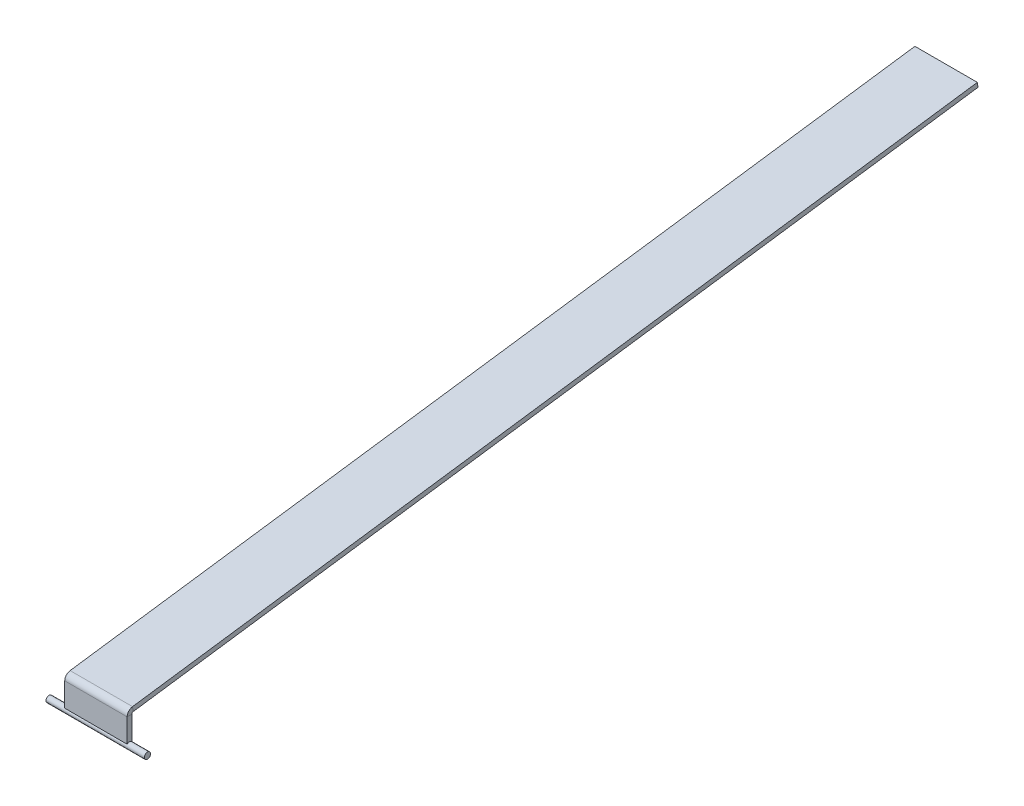
ISO-10303-21;
HEADER;
FILE_DESCRIPTION(('STEP AP214'),'2;1');
FILE_NAME('part.step','',(''),(''),'','','');
FILE_SCHEMA(('AUTOMOTIVE_DESIGN { 1 0 10303 214 1 1 1 1 }'));
ENDSEC;
DATA;
#1=APPLICATION_CONTEXT('core data for automotive mechanical design processes');
#2=APPLICATION_PROTOCOL_DEFINITION('international standard','automotive_design',2000,#1);
#3=PRODUCT_CONTEXT('',#1,'mechanical');
#4=PRODUCT('Part','Part','',(#3));
#5=PRODUCT_RELATED_PRODUCT_CATEGORY('part','',(#4));
#6=PRODUCT_DEFINITION_FORMATION('','',#4);
#7=PRODUCT_DEFINITION_CONTEXT('part definition',#1,'design');
#8=PRODUCT_DEFINITION('design','',#6,#7);
#9=PRODUCT_DEFINITION_SHAPE('','',#8);
#10=(LENGTH_UNIT() NAMED_UNIT(*) SI_UNIT(.MILLI.,.METRE.));
#11=(NAMED_UNIT(*) PLANE_ANGLE_UNIT() SI_UNIT($,.RADIAN.));
#12=(NAMED_UNIT(*) SI_UNIT($,.STERADIAN.) SOLID_ANGLE_UNIT());
#13=UNCERTAINTY_MEASURE_WITH_UNIT(LENGTH_MEASURE(1.E-05),#10,'distance_accuracy_value','');
#14=(GEOMETRIC_REPRESENTATION_CONTEXT(3) GLOBAL_UNCERTAINTY_ASSIGNED_CONTEXT((#13)) GLOBAL_UNIT_ASSIGNED_CONTEXT((#10,
#11,#12)) REPRESENTATION_CONTEXT('',''));
#15=CARTESIAN_POINT('',(0.,0.,0.));
#16=DIRECTION('',(0.,0.,1.));
#17=DIRECTION('',(1.,0.,0.));
#18=AXIS2_PLACEMENT_3D('',#15,#16,#17);
#19=CARTESIAN_POINT('',(2.,0.,0.));
#20=DIRECTION('',(0.,0.,1.));
#21=DIRECTION('',(1.,0.,0.));
#22=AXIS2_PLACEMENT_3D('',#19,#20,#21);
#23=PLANE('',#22);
#24=DIRECTION('',(0.,1.,0.));
#25=VECTOR('',#24,1.);
#26=CARTESIAN_POINT('',(-2.,0.,0.));
#27=LINE('',#26,#25);
#28=CARTESIAN_POINT('',(-2.,0.33228756555323,0.));
#29=VERTEX_POINT('',#28);
#30=CARTESIAN_POINT('',(-2.,1.85207502322455,0.));
#31=VERTEX_POINT('',#30);
#32=EDGE_CURVE('E163',#29,#31,#27,.T.);
#33=ORIENTED_EDGE('',*,*,#32,.F.);
#34=DIRECTION('',(-1.,0.,0.));
#35=VECTOR('',#34,1.);
#36=CARTESIAN_POINT('',(3.15,0.33228756555323,0.));
#37=LINE('',#36,#35);
#38=CARTESIAN_POINT('',(2.,0.33228756555323,0.));
#39=VERTEX_POINT('',#38);
#40=EDGE_CURVE('E120',#29,#39,#37,.F.);
#41=ORIENTED_EDGE('',*,*,#40,.T.);
#42=DIRECTION('',(0.,1.,0.));
#43=VECTOR('',#42,1.);
#44=CARTESIAN_POINT('',(2.,0.,0.));
#45=LINE('',#44,#43);
#46=CARTESIAN_POINT('',(2.,1.85207502322455,0.));
#47=VERTEX_POINT('',#46);
#48=EDGE_CURVE('E112',#39,#47,#45,.T.);
#49=ORIENTED_EDGE('',*,*,#48,.T.);
#50=DIRECTION('',(-1.,0.,0.));
#51=VECTOR('',#50,1.);
#52=CARTESIAN_POINT('',(2.,1.85207502322455,0.));
#53=LINE('',#52,#51);
#54=EDGE_CURVE('E116',#47,#31,#53,.T.);
#55=ORIENTED_EDGE('',*,*,#54,.T.);
#56=EDGE_LOOP('',(#33,#41,#49,#55));
#57=FACE_BOUND('',#56,.T.);
#58=ADVANCED_FACE('F43',(#57),#23,.T.);
#59=CARTESIAN_POINT('',(2.,0.,-0.3));
#60=DIRECTION('',(0.,0.,1.));
#61=DIRECTION('',(1.,0.,0.));
#62=AXIS2_PLACEMENT_3D('',#59,#60,#61);
#63=PLANE('',#62);
#64=DIRECTION('',(-1.,0.,0.));
#65=VECTOR('',#64,1.);
#66=CARTESIAN_POINT('',(3.15,0.33228756555323,-0.3));
#67=LINE('',#66,#65);
#68=CARTESIAN_POINT('',(-2.,0.33228756555323,-0.3));
#69=VERTEX_POINT('',#68);
#70=CARTESIAN_POINT('',(2.,0.33228756555323,-0.3));
#71=VERTEX_POINT('',#70);
#72=EDGE_CURVE('E58',#69,#71,#67,.F.);
#73=ORIENTED_EDGE('',*,*,#72,.F.);
#74=DIRECTION('',(0.,1.,0.));
#75=VECTOR('',#74,1.);
#76=CARTESIAN_POINT('',(-2.,0.,-0.3));
#77=LINE('',#76,#75);
#78=CARTESIAN_POINT('',(-2.,1.85207502322455,-0.3));
#79=VERTEX_POINT('',#78);
#80=EDGE_CURVE('E165',#69,#79,#77,.T.);
#81=ORIENTED_EDGE('',*,*,#80,.T.);
#82=DIRECTION('',(-1.,0.,0.));
#83=VECTOR('',#82,1.);
#84=CARTESIAN_POINT('',(2.,1.85207502322455,-0.3));
#85=LINE('',#84,#83);
#86=CARTESIAN_POINT('',(2.,1.85207502322455,-0.3));
#87=VERTEX_POINT('',#86);
#88=EDGE_CURVE('E138',#87,#79,#85,.T.);
#89=ORIENTED_EDGE('',*,*,#88,.F.);
#90=DIRECTION('',(0.,1.,0.));
#91=VECTOR('',#90,1.);
#92=CARTESIAN_POINT('',(2.,0.,-0.3));
#93=LINE('',#92,#91);
#94=EDGE_CURVE('E122',#71,#87,#93,.T.);
#95=ORIENTED_EDGE('',*,*,#94,.F.);
#96=EDGE_LOOP('',(#73,#81,#89,#95));
#97=FACE_BOUND('',#96,.T.);
#98=ADVANCED_FACE('F205',(#97),#63,.F.);
#99=CARTESIAN_POINT('',(-2.,1.95111014481228,-0.386141980945912));
#100=DIRECTION('',(-1.,0.,0.));
#101=DIRECTION('',(0.,0.,1.));
#102=AXIS2_PLACEMENT_3D('',#99,#100,#101);
#103=PLANE('',#102);
#104=ORIENTED_EDGE('',*,*,#80,.F.);
#105=CARTESIAN_POINT('',(-2.,0.2,-0.15));
#106=DIRECTION('',(-1.,0.,0.));
#107=DIRECTION('',(0.,0.,1.));
#108=AXIS2_PLACEMENT_3D('',#105,#106,#107);
#109=CIRCLE('',#108,0.2);
#110=EDGE_CURVE('E314',#69,#29,#109,.F.);
#111=ORIENTED_EDGE('',*,*,#110,.T.);
#112=ORIENTED_EDGE('',*,*,#32,.T.);
#113=DIRECTION('',(0.,0.,-1.));
#114=VECTOR('',#113,1.);
#115=CARTESIAN_POINT('',(-2.,1.85207502322455,0.));
#116=LINE('',#115,#114);
#117=EDGE_CURVE('E131',#31,#79,#116,.T.);
#118=ORIENTED_EDGE('',*,*,#117,.T.);
#119=EDGE_LOOP('',(#104,#111,#112,#118));
#120=FACE_BOUND('',#119,.T.);
#121=ADVANCED_FACE('F183',(#120),#103,.T.);
#122=CARTESIAN_POINT('',(2.,1.85207502322455,-0.4));
#123=DIRECTION('',(1.,0.,0.));
#124=DIRECTION('',(0.,0.,-1.));
#125=AXIS2_PLACEMENT_3D('',#122,#123,#124);
#126=PLANE('',#125);
#127=ORIENTED_EDGE('',*,*,#48,.F.);
#128=CARTESIAN_POINT('',(2.,0.2,-0.15));
#129=DIRECTION('',(1.,0.,0.));
#130=DIRECTION('',(0.,0.,-1.));
#131=AXIS2_PLACEMENT_3D('',#128,#129,#130);
#132=CIRCLE('',#131,0.2);
#133=EDGE_CURVE('E308',#39,#71,#132,.F.);
#134=ORIENTED_EDGE('',*,*,#133,.T.);
#135=ORIENTED_EDGE('',*,*,#94,.T.);
#136=DIRECTION('',(0.,0.,1.));
#137=VECTOR('',#136,1.);
#138=CARTESIAN_POINT('',(2.,1.85207502322455,-0.3));
#139=LINE('',#138,#137);
#140=EDGE_CURVE('E51',#87,#47,#139,.T.);
#141=ORIENTED_EDGE('',*,*,#140,.T.);
#142=EDGE_LOOP('',(#127,#134,#135,#141));
#143=FACE_BOUND('',#142,.T.);
#144=ADVANCED_FACE('F126',(#143),#126,.T.);
#145=CARTESIAN_POINT('',(2.,2.24821550957547,-0.344567923783648));
#146=DIRECTION('',(1.,0.,0.));
#147=DIRECTION('',(0.,0.,-1.));
#148=AXIS2_PLACEMENT_3D('',#145,#146,#147);
#149=PLANE('',#148);
#150=DIRECTION('',(0.,-0.990351215877303,-0.138580190540881));
#151=VECTOR('',#150,1.);
#152=CARTESIAN_POINT('',(2.,2.24821550957547,-0.344567923783648));
#153=LINE('',#152,#151);
#154=CARTESIAN_POINT('',(2.,2.24821550957547,-0.344567923783648));
#155=VERTEX_POINT('',#154);
#156=CARTESIAN_POINT('',(2.,1.95111014481228,-0.386141980945912));
#157=VERTEX_POINT('',#156);
#158=EDGE_CURVE('E11',#155,#157,#153,.T.);
#159=ORIENTED_EDGE('',*,*,#158,.F.);
#160=CARTESIAN_POINT('',(2.,1.85207502322455,-0.4));
#161=DIRECTION('',(1.,0.,0.));
#162=DIRECTION('',(0.,0.,-1.));
#163=AXIS2_PLACEMENT_3D('',#160,#161,#162);
#164=CIRCLE('',#163,0.4);
#165=EDGE_CURVE('E123',#47,#155,#164,.F.);
#166=ORIENTED_EDGE('',*,*,#165,.F.);
#167=ORIENTED_EDGE('',*,*,#140,.F.);
#168=CARTESIAN_POINT('',(2.,1.85207502322455,-0.4));
#169=DIRECTION('',(1.,0.,0.));
#170=DIRECTION('',(0.,0.,-1.));
#171=AXIS2_PLACEMENT_3D('',#168,#169,#170);
#172=CIRCLE('',#171,0.1);
#173=EDGE_CURVE('E149',#87,#157,#172,.F.);
#174=ORIENTED_EDGE('',*,*,#173,.T.);
#175=EDGE_LOOP('',(#159,#166,#167,#174));
#176=FACE_BOUND('',#175,.T.);
#177=ADVANCED_FACE('F45',(#176),#149,.T.);
#178=CARTESIAN_POINT('',(2.,1.85207502322455,-0.3));
#179=DIRECTION('',(1.,0.,0.));
#180=DIRECTION('',(0.,0.,-1.));
#181=AXIS2_PLACEMENT_3D('',#178,#179,#180);
#182=PLANE('',#181);
#183=DIRECTION('',(0.,0.13858019054088,-0.990351215877304));
#184=VECTOR('',#183,1.);
#185=CARTESIAN_POINT('',(2.,2.2,0.));
#186=LINE('',#185,#184);
#187=CARTESIAN_POINT('',(2.,9.82191047974842,-54.4693168732517));
#188=VERTEX_POINT('',#187);
#189=EDGE_CURVE('E141',#155,#188,#186,.T.);
#190=ORIENTED_EDGE('',*,*,#189,.F.);
#191=ORIENTED_EDGE('',*,*,#158,.T.);
#192=DIRECTION('',(0.,0.13858019054088,-0.990351215877304));
#193=VECTOR('',#192,1.);
#194=CARTESIAN_POINT('',(2.,1.90289463523681,-0.0415740571622641));
#195=LINE('',#194,#193);
#196=CARTESIAN_POINT('',(2.,9.52480511498523,-54.510890930414));
#197=VERTEX_POINT('',#196);
#198=EDGE_CURVE('E99',#157,#197,#195,.T.);
#199=ORIENTED_EDGE('',*,*,#198,.T.);
#200=DIRECTION('',(0.,-0.990351215877297,-0.138580190540925));
#201=VECTOR('',#200,1.);
#202=CARTESIAN_POINT('',(2.,9.82191047974842,-54.4693168732517));
#203=LINE('',#202,#201);
#204=EDGE_CURVE('E144',#188,#197,#203,.T.);
#205=ORIENTED_EDGE('',*,*,#204,.F.);
#206=EDGE_LOOP('',(#190,#191,#199,#205));
#207=FACE_BOUND('',#206,.T.);
#208=ADVANCED_FACE('F194',(#207),#182,.T.);
#209=CARTESIAN_POINT('',(-2.,1.85207502322455,0.));
#210=DIRECTION('',(-1.,0.,0.));
#211=DIRECTION('',(0.,0.,1.));
#212=AXIS2_PLACEMENT_3D('',#209,#210,#211);
#213=PLANE('',#212);
#214=ORIENTED_EDGE('',*,*,#117,.F.);
#215=CARTESIAN_POINT('',(-2.,1.85207502322455,-0.4));
#216=DIRECTION('',(1.,0.,0.));
#217=DIRECTION('',(0.,0.,-1.));
#218=AXIS2_PLACEMENT_3D('',#215,#216,#217);
#219=CIRCLE('',#218,0.4);
#220=CARTESIAN_POINT('',(-2.,2.24821550957547,-0.344567923783648));
#221=VERTEX_POINT('',#220);
#222=EDGE_CURVE('E136',#31,#221,#219,.F.);
#223=ORIENTED_EDGE('',*,*,#222,.T.);
#224=DIRECTION('',(0.,0.990351215877303,0.138580190540881));
#225=VECTOR('',#224,1.);
#226=CARTESIAN_POINT('',(-2.,1.95111014481228,-0.386141980945912));
#227=LINE('',#226,#225);
#228=CARTESIAN_POINT('',(-2.,1.95111014481228,-0.386141980945912));
#229=VERTEX_POINT('',#228);
#230=EDGE_CURVE('E93',#229,#221,#227,.T.);
#231=ORIENTED_EDGE('',*,*,#230,.F.);
#232=CARTESIAN_POINT('',(-2.,1.85207502322455,-0.4));
#233=DIRECTION('',(1.,0.,0.));
#234=DIRECTION('',(0.,0.,-1.));
#235=AXIS2_PLACEMENT_3D('',#232,#233,#234);
#236=CIRCLE('',#235,0.1);
#237=EDGE_CURVE('E167',#79,#229,#236,.F.);
#238=ORIENTED_EDGE('',*,*,#237,.F.);
#239=EDGE_LOOP('',(#214,#223,#231,#238));
#240=FACE_BOUND('',#239,.T.);
#241=ADVANCED_FACE('F191',(#240),#213,.T.);
#242=CARTESIAN_POINT('',(2.,1.90289463523681,-0.0415740571622641));
#243=DIRECTION('',(0.,0.990351215877303,0.13858019054088));
#244=DIRECTION('',(0.,-0.13858019054088,0.990351215877303));
#245=AXIS2_PLACEMENT_3D('',#242,#243,#244);
#246=PLANE('',#245);
#247=DIRECTION('',(0.,0.13858019054088,-0.990351215877304));
#248=VECTOR('',#247,1.);
#249=CARTESIAN_POINT('',(-2.,1.90289463523681,-0.0415740571622641));
#250=LINE('',#249,#248);
#251=CARTESIAN_POINT('',(-2.,9.52480511498523,-54.510890930414));
#252=VERTEX_POINT('',#251);
#253=EDGE_CURVE('E152',#229,#252,#250,.T.);
#254=ORIENTED_EDGE('',*,*,#253,.T.);
#255=DIRECTION('',(-1.,0.,0.));
#256=VECTOR('',#255,1.);
#257=CARTESIAN_POINT('',(2.,9.52480511498523,-54.510890930414));
#258=LINE('',#257,#256);
#259=EDGE_CURVE('E176',#197,#252,#258,.T.);
#260=ORIENTED_EDGE('',*,*,#259,.F.);
#261=ORIENTED_EDGE('',*,*,#198,.F.);
#262=DIRECTION('',(-1.,0.,0.));
#263=VECTOR('',#262,1.);
#264=CARTESIAN_POINT('',(2.,1.95111014481228,-0.386141980945912));
#265=LINE('',#264,#263);
#266=EDGE_CURVE('E151',#157,#229,#265,.T.);
#267=ORIENTED_EDGE('',*,*,#266,.T.);
#268=EDGE_LOOP('',(#254,#260,#261,#267));
#269=FACE_BOUND('',#268,.T.);
#270=ADVANCED_FACE('F193',(#269),#246,.F.);
#271=CARTESIAN_POINT('',(2.,9.82191047974842,-54.4693168732517));
#272=DIRECTION('',(0.,0.138580190540925,-0.990351215877297));
#273=DIRECTION('',(0.,0.990351215877297,0.138580190540925));
#274=AXIS2_PLACEMENT_3D('',#271,#272,#273);
#275=PLANE('',#274);
#276=DIRECTION('',(0.,-0.990351215877297,-0.138580190540925));
#277=VECTOR('',#276,1.);
#278=CARTESIAN_POINT('',(-2.,9.82191047974842,-54.4693168732517));
#279=LINE('',#278,#277);
#280=CARTESIAN_POINT('',(-2.,9.82191047974842,-54.4693168732517));
#281=VERTEX_POINT('',#280);
#282=EDGE_CURVE('E155',#281,#252,#279,.T.);
#283=ORIENTED_EDGE('',*,*,#282,.F.);
#284=DIRECTION('',(-1.,0.,0.));
#285=VECTOR('',#284,1.);
#286=CARTESIAN_POINT('',(2.,9.82191047974842,-54.4693168732517));
#287=LINE('',#286,#285);
#288=EDGE_CURVE('E174',#188,#281,#287,.T.);
#289=ORIENTED_EDGE('',*,*,#288,.F.);
#290=ORIENTED_EDGE('',*,*,#204,.T.);
#291=ORIENTED_EDGE('',*,*,#259,.T.);
#292=EDGE_LOOP('',(#283,#289,#290,#291));
#293=FACE_BOUND('',#292,.T.);
#294=ADVANCED_FACE('F200',(#293),#275,.T.);
#295=CARTESIAN_POINT('',(2.,2.2,0.));
#296=DIRECTION('',(0.,0.990351215877303,0.13858019054088));
#297=DIRECTION('',(0.,-0.13858019054088,0.990351215877303));
#298=AXIS2_PLACEMENT_3D('',#295,#296,#297);
#299=PLANE('',#298);
#300=DIRECTION('',(0.,0.13858019054088,-0.990351215877304));
#301=VECTOR('',#300,1.);
#302=CARTESIAN_POINT('',(-2.,2.2,0.));
#303=LINE('',#302,#301);
#304=EDGE_CURVE('E159',#221,#281,#303,.T.);
#305=ORIENTED_EDGE('',*,*,#304,.F.);
#306=DIRECTION('',(-1.,0.,0.));
#307=VECTOR('',#306,1.);
#308=CARTESIAN_POINT('',(2.,2.24821550957547,-0.344567923783648));
#309=LINE('',#308,#307);
#310=EDGE_CURVE('E137',#155,#221,#309,.T.);
#311=ORIENTED_EDGE('',*,*,#310,.F.);
#312=ORIENTED_EDGE('',*,*,#189,.T.);
#313=ORIENTED_EDGE('',*,*,#288,.T.);
#314=EDGE_LOOP('',(#305,#311,#312,#313));
#315=FACE_BOUND('',#314,.T.);
#316=ADVANCED_FACE('F216',(#315),#299,.T.);
#317=CARTESIAN_POINT('',(2.,1.85207502322455,-0.4));
#318=DIRECTION('',(-1.,0.,0.));
#319=DIRECTION('',(0.,0.,1.));
#320=AXIS2_PLACEMENT_3D('',#317,#318,#319);
#321=CYLINDRICAL_SURFACE('',#320,0.4);
#322=ORIENTED_EDGE('',*,*,#222,.F.);
#323=ORIENTED_EDGE('',*,*,#54,.F.);
#324=ORIENTED_EDGE('',*,*,#165,.T.);
#325=ORIENTED_EDGE('',*,*,#310,.T.);
#326=EDGE_LOOP('',(#322,#323,#324,#325));
#327=FACE_BOUND('',#326,.T.);
#328=ADVANCED_FACE('F134',(#327),#321,.T.);
#329=CARTESIAN_POINT('',(2.,1.85207502322455,-0.4));
#330=DIRECTION('',(-1.,0.,0.));
#331=DIRECTION('',(0.,0.,1.));
#332=AXIS2_PLACEMENT_3D('',#329,#330,#331);
#333=CYLINDRICAL_SURFACE('',#332,0.1);
#334=ORIENTED_EDGE('',*,*,#237,.T.);
#335=ORIENTED_EDGE('',*,*,#266,.F.);
#336=ORIENTED_EDGE('',*,*,#173,.F.);
#337=ORIENTED_EDGE('',*,*,#88,.T.);
#338=EDGE_LOOP('',(#334,#335,#336,#337));
#339=FACE_BOUND('',#338,.T.);
#340=ADVANCED_FACE('F188',(#339),#333,.F.);
#341=CARTESIAN_POINT('',(-2.,1.85207502322455,-0.4));
#342=DIRECTION('',(1.,0.,0.));
#343=DIRECTION('',(0.,0.,-1.));
#344=AXIS2_PLACEMENT_3D('',#341,#342,#343);
#345=PLANE('',#344);
#346=ORIENTED_EDGE('',*,*,#253,.F.);
#347=ORIENTED_EDGE('',*,*,#230,.T.);
#348=ORIENTED_EDGE('',*,*,#304,.T.);
#349=ORIENTED_EDGE('',*,*,#282,.T.);
#350=EDGE_LOOP('',(#346,#347,#348,#349));
#351=FACE_BOUND('',#350,.T.);
#352=ADVANCED_FACE('F236',(#351),#345,.F.);
#353=CARTESIAN_POINT('',(3.15,0.2,-0.15));
#354=DIRECTION('',(-1.,0.,0.));
#355=DIRECTION('',(0.,0.,1.));
#356=AXIS2_PLACEMENT_3D('',#353,#354,#355);
#357=CYLINDRICAL_SURFACE('',#356,0.2);
#358=CARTESIAN_POINT('',(2.,0.2,-0.15));
#359=DIRECTION('',(-1.,0.,0.));
#360=DIRECTION('',(0.,-0.661437827766148,-0.75));
#361=AXIS2_PLACEMENT_3D('',#358,#359,#360);
#362=CIRCLE('',#361,0.2);
#363=CARTESIAN_POINT('',(2.,0.0677124344467704,-0.3));
#364=VERTEX_POINT('',#363);
#365=CARTESIAN_POINT('',(2.,0.0677124344467704,0.));
#366=VERTEX_POINT('',#365);
#367=EDGE_CURVE('E156',#364,#366,#362,.T.);
#368=ORIENTED_EDGE('',*,*,#367,.T.);
#369=ORIENTED_EDGE('',*,*,#367,.F.);
#370=EDGE_LOOP('',(#368,#369));
#371=FACE_BOUND('',#370,.T.);
#372=CARTESIAN_POINT('',(-2.,0.2,-0.15));
#373=DIRECTION('',(-1.,0.,0.));
#374=DIRECTION('',(0.,-0.661437827766148,-0.75));
#375=AXIS2_PLACEMENT_3D('',#372,#373,#374);
#376=CIRCLE('',#375,0.2);
#377=CARTESIAN_POINT('',(-2.,0.0677124344467704,-0.3));
#378=VERTEX_POINT('',#377);
#379=CARTESIAN_POINT('',(-2.,0.0677124344467704,0.));
#380=VERTEX_POINT('',#379);
#381=EDGE_CURVE('E316',#378,#380,#376,.T.);
#382=ORIENTED_EDGE('',*,*,#381,.F.);
#383=ORIENTED_EDGE('',*,*,#381,.T.);
#384=EDGE_LOOP('',(#382,#383));
#385=FACE_BOUND('',#384,.T.);
#386=ORIENTED_EDGE('',*,*,#110,.F.);
#387=ORIENTED_EDGE('',*,*,#72,.T.);
#388=ORIENTED_EDGE('',*,*,#133,.F.);
#389=ORIENTED_EDGE('',*,*,#40,.F.);
#390=EDGE_LOOP('',(#386,#387,#388,#389));
#391=FACE_BOUND('',#390,.T.);
#392=CARTESIAN_POINT('',(3.15,0.2,-0.15));
#393=DIRECTION('',(1.,0.,0.));
#394=DIRECTION('',(0.,0.,-1.));
#395=AXIS2_PLACEMENT_3D('',#392,#393,#394);
#396=CIRCLE('',#395,0.2);
#397=CARTESIAN_POINT('',(3.15,0.2,-0.35));
#398=VERTEX_POINT('',#397);
#399=EDGE_CURVE('E305',#398,#398,#396,.T.);
#400=ORIENTED_EDGE('',*,*,#399,.F.);
#401=EDGE_LOOP('',(#400));
#402=FACE_BOUND('',#401,.T.);
#403=CARTESIAN_POINT('',(-3.15,0.2,-0.15));
#404=DIRECTION('',(1.,0.,0.));
#405=DIRECTION('',(0.,0.,-1.));
#406=AXIS2_PLACEMENT_3D('',#403,#404,#405);
#407=CIRCLE('',#406,0.2);
#408=CARTESIAN_POINT('',(-3.15,0.2,-0.35));
#409=VERTEX_POINT('',#408);
#410=EDGE_CURVE('E303',#409,#409,#407,.T.);
#411=ORIENTED_EDGE('',*,*,#410,.T.);
#412=EDGE_LOOP('',(#411));
#413=FACE_BOUND('',#412,.T.);
#414=ADVANCED_FACE('F233',(#371,#385,#391,#402,#413),#357,.T.);
#415=CARTESIAN_POINT('',(3.15,0.2,-0.15));
#416=DIRECTION('',(1.,0.,0.));
#417=DIRECTION('',(0.,0.,-1.));
#418=AXIS2_PLACEMENT_3D('',#415,#416,#417);
#419=PLANE('',#418);
#420=ORIENTED_EDGE('',*,*,#399,.T.);
#421=EDGE_LOOP('',(#420));
#422=FACE_BOUND('',#421,.T.);
#423=ADVANCED_FACE('F280',(#422),#419,.T.);
#424=CARTESIAN_POINT('',(-3.15,0.2,-0.15));
#425=DIRECTION('',(1.,0.,0.));
#426=DIRECTION('',(0.,0.,-1.));
#427=AXIS2_PLACEMENT_3D('',#424,#425,#426);
#428=PLANE('',#427);
#429=ORIENTED_EDGE('',*,*,#410,.F.);
#430=EDGE_LOOP('',(#429));
#431=FACE_BOUND('',#430,.T.);
#432=ADVANCED_FACE('F289',(#431),#428,.F.);
#433=CLOSED_SHELL('',(#58,#98,#121,#144,#177,#208,#241,#270,#294,#316,#328,#340,#352,#414,#423,#432));
#434=MANIFOLD_SOLID_BREP('B2',#433);
#435=ADVANCED_BREP_SHAPE_REPRESENTATION('',(#18,#434),#14);
#436=SHAPE_DEFINITION_REPRESENTATION(#9,#435);
ENDSEC;
END-ISO-10303-21;
